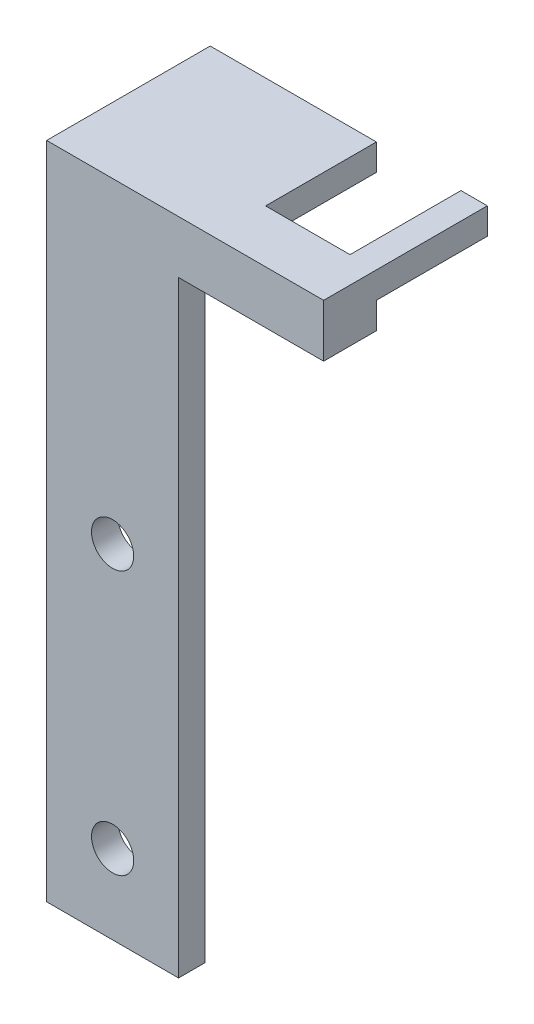
ISO-10303-21;
HEADER;
FILE_DESCRIPTION(('STEP AP214'),'2;1');
FILE_NAME('part.step','',(''),(''),'','','');
FILE_SCHEMA(('AUTOMOTIVE_DESIGN { 1 0 10303 214 1 1 1 1 }'));
ENDSEC;
DATA;
#1=APPLICATION_CONTEXT('core data for automotive mechanical design processes');
#2=APPLICATION_PROTOCOL_DEFINITION('international standard','automotive_design',2000,#1);
#3=PRODUCT_CONTEXT('',#1,'mechanical');
#4=PRODUCT('Part','Part','',(#3));
#5=PRODUCT_RELATED_PRODUCT_CATEGORY('part','',(#4));
#6=PRODUCT_DEFINITION_FORMATION('','',#4);
#7=PRODUCT_DEFINITION_CONTEXT('part definition',#1,'design');
#8=PRODUCT_DEFINITION('design','',#6,#7);
#9=PRODUCT_DEFINITION_SHAPE('','',#8);
#10=(LENGTH_UNIT() NAMED_UNIT(*) SI_UNIT(.MILLI.,.METRE.));
#11=(NAMED_UNIT(*) PLANE_ANGLE_UNIT() SI_UNIT($,.RADIAN.));
#12=(NAMED_UNIT(*) SI_UNIT($,.STERADIAN.) SOLID_ANGLE_UNIT());
#13=UNCERTAINTY_MEASURE_WITH_UNIT(LENGTH_MEASURE(1.E-05),#10,'distance_accuracy_value','');
#14=(GEOMETRIC_REPRESENTATION_CONTEXT(3) GLOBAL_UNCERTAINTY_ASSIGNED_CONTEXT((#13)) GLOBAL_UNIT_ASSIGNED_CONTEXT((#10,
#11,#12)) REPRESENTATION_CONTEXT('',''));
#15=CARTESIAN_POINT('',(0.,0.,0.));
#16=DIRECTION('',(0.,0.,1.));
#17=DIRECTION('',(1.,0.,0.));
#18=AXIS2_PLACEMENT_3D('',#15,#16,#17);
#19=CARTESIAN_POINT('',(0.,26.2979779965765,0.));
#20=DIRECTION('',(0.,1.,0.));
#21=DIRECTION('',(0.,0.,1.));
#22=AXIS2_PLACEMENT_3D('',#19,#20,#21);
#23=PLANE('',#22);
#24=DIRECTION('',(1.,0.,0.));
#25=VECTOR('',#24,1.);
#26=CARTESIAN_POINT('',(0.,26.2979779965765,-3.175));
#27=LINE('',#26,#25);
#28=CARTESIAN_POINT('',(-16.342182644396,26.2979779965765,-3.175));
#29=VERTEX_POINT('',#28);
#30=CARTESIAN_POINT('',(3.66031735560397,26.2979779965765,-3.175));
#31=VERTEX_POINT('',#30);
#32=EDGE_CURVE('E198',#29,#31,#27,.T.);
#33=ORIENTED_EDGE('',*,*,#32,.F.);
#34=DIRECTION('',(0.,0.,-1.));
#35=VECTOR('',#34,1.);
#36=CARTESIAN_POINT('',(-16.342182644396,26.2979779965765,0.));
#37=LINE('',#36,#35);
#38=CARTESIAN_POINT('',(-16.342182644396,26.2979779965765,-16.51));
#39=VERTEX_POINT('',#38);
#40=EDGE_CURVE('E75',#29,#39,#37,.T.);
#41=ORIENTED_EDGE('',*,*,#40,.T.);
#42=DIRECTION('',(1.,0.,0.));
#43=VECTOR('',#42,1.);
#44=CARTESIAN_POINT('',(0.,26.2979779965765,-16.51));
#45=LINE('',#44,#43);
#46=CARTESIAN_POINT('',(3.66031735560397,26.2979779965765,-16.51));
#47=VERTEX_POINT('',#46);
#48=EDGE_CURVE('E179',#39,#47,#45,.T.);
#49=ORIENTED_EDGE('',*,*,#48,.T.);
#50=DIRECTION('',(0.,0.,-1.));
#51=VECTOR('',#50,1.);
#52=CARTESIAN_POINT('',(3.66031735560397,26.2979779965765,0.));
#53=LINE('',#52,#51);
#54=EDGE_CURVE('E181',#31,#47,#53,.T.);
#55=ORIENTED_EDGE('',*,*,#54,.F.);
#56=EDGE_LOOP('',(#33,#41,#49,#55));
#57=FACE_BOUND('',#56,.T.);
#58=ADVANCED_FACE('F35',(#57),#23,.F.);
#59=DIRECTION('',(1.,0.,0.));
#60=VECTOR('',#59,1.);
#61=CARTESIAN_POINT('',(0.,26.2979779965765,-3.175));
#62=LINE('',#61,#60);
#63=CARTESIAN_POINT('',(13.820317355604,26.2979779965765,-3.175));
#64=VERTEX_POINT('',#63);
#65=CARTESIAN_POINT('',(16.995317355604,26.2979779965765,-3.175));
#66=VERTEX_POINT('',#65);
#67=EDGE_CURVE('E11',#64,#66,#62,.T.);
#68=ORIENTED_EDGE('',*,*,#67,.F.);
#69=DIRECTION('',(0.,0.,-1.));
#70=VECTOR('',#69,1.);
#71=CARTESIAN_POINT('',(13.820317355604,26.2979779965765,0.));
#72=LINE('',#71,#70);
#73=CARTESIAN_POINT('',(13.820317355604,26.2979779965765,-16.5312104718893));
#74=VERTEX_POINT('',#73);
#75=EDGE_CURVE('E184',#64,#74,#72,.T.);
#76=ORIENTED_EDGE('',*,*,#75,.T.);
#77=DIRECTION('',(-1.,0.,0.));
#78=VECTOR('',#77,1.);
#79=CARTESIAN_POINT('',(0.,26.2979779965765,-16.5312104718893));
#80=LINE('',#79,#78);
#81=CARTESIAN_POINT('',(16.995317355604,26.2979779965765,-16.5312104718893));
#82=VERTEX_POINT('',#81);
#83=EDGE_CURVE('E187',#82,#74,#80,.T.);
#84=ORIENTED_EDGE('',*,*,#83,.F.);
#85=DIRECTION('',(0.,0.,-1.));
#86=VECTOR('',#85,1.);
#87=CARTESIAN_POINT('',(16.995317355604,26.2979779965765,0.));
#88=LINE('',#87,#86);
#89=EDGE_CURVE('E162',#66,#82,#88,.T.);
#90=ORIENTED_EDGE('',*,*,#89,.F.);
#91=EDGE_LOOP('',(#68,#76,#84,#90));
#92=FACE_BOUND('',#91,.T.);
#93=ADVANCED_FACE('F259',(#92),#23,.F.);
#94=CARTESIAN_POINT('',(0.,0.,0.));
#95=DIRECTION('',(0.,0.,1.));
#96=DIRECTION('',(1.,0.,0.));
#97=AXIS2_PLACEMENT_3D('',#94,#95,#96);
#98=PLANE('',#97);
#99=CARTESIAN_POINT('',(-8.40468264439601,-40.3770220034235,0.));
#100=DIRECTION('',(0.,0.,1.));
#101=DIRECTION('',(1.,0.,0.));
#102=AXIS2_PLACEMENT_3D('',#99,#100,#101);
#103=CIRCLE('',#102,2.54);
#104=CARTESIAN_POINT('',(-5.86468264439601,-40.3770220034235,0.));
#105=VERTEX_POINT('',#104);
#106=EDGE_CURVE('E138',#105,#105,#103,.T.);
#107=ORIENTED_EDGE('',*,*,#106,.T.);
#108=EDGE_LOOP('',(#107));
#109=FACE_BOUND('',#108,.T.);
#110=CARTESIAN_POINT('',(-8.40468264439602,-8.62702200342354,0.));
#111=DIRECTION('',(0.,0.,1.));
#112=DIRECTION('',(1.,0.,0.));
#113=AXIS2_PLACEMENT_3D('',#110,#111,#112);
#114=CIRCLE('',#113,2.54);
#115=CARTESIAN_POINT('',(-5.86468264439602,-8.62702200342354,0.));
#116=VERTEX_POINT('',#115);
#117=EDGE_CURVE('E132',#116,#116,#114,.T.);
#118=ORIENTED_EDGE('',*,*,#117,.T.);
#119=EDGE_LOOP('',(#118));
#120=FACE_BOUND('',#119,.T.);
#121=DIRECTION('',(0.,-1.,0.));
#122=VECTOR('',#121,1.);
#123=CARTESIAN_POINT('',(-16.342182644396,29.4729779965765,0.));
#124=LINE('',#123,#122);
#125=CARTESIAN_POINT('',(-16.342182644396,23.1229779965765,0.));
#126=VERTEX_POINT('',#125);
#127=CARTESIAN_POINT('',(-16.342182644396,-49.9020220034235,0.));
#128=VERTEX_POINT('',#127);
#129=EDGE_CURVE('E65',#126,#128,#124,.T.);
#130=ORIENTED_EDGE('',*,*,#129,.F.);
#131=DIRECTION('',(1.,0.,0.));
#132=VECTOR('',#131,1.);
#133=CARTESIAN_POINT('',(0.,23.1229779965765,0.));
#134=LINE('',#133,#132);
#135=CARTESIAN_POINT('',(-0.46718264439603,23.1229779965765,0.));
#136=VERTEX_POINT('',#135);
#137=EDGE_CURVE('E197',#126,#136,#134,.T.);
#138=ORIENTED_EDGE('',*,*,#137,.T.);
#139=DIRECTION('',(0.,1.,0.));
#140=VECTOR('',#139,1.);
#141=CARTESIAN_POINT('',(-0.46718264439603,29.4729779965765,0.));
#142=LINE('',#141,#140);
#143=CARTESIAN_POINT('',(-0.467182644396016,-49.9020220034235,0.));
#144=VERTEX_POINT('',#143);
#145=EDGE_CURVE('E118',#144,#136,#142,.T.);
#146=ORIENTED_EDGE('',*,*,#145,.F.);
#147=DIRECTION('',(1.,0.,0.));
#148=VECTOR('',#147,1.);
#149=CARTESIAN_POINT('',(-16.342182644396,-49.9020220034235,0.));
#150=LINE('',#149,#148);
#151=EDGE_CURVE('E126',#128,#144,#150,.T.);
#152=ORIENTED_EDGE('',*,*,#151,.F.);
#153=EDGE_LOOP('',(#130,#138,#146,#152));
#154=FACE_BOUND('',#153,.T.);
#155=ADVANCED_FACE('F281',(#109,#120,#154),#98,.F.);
#156=CARTESIAN_POINT('',(-0.46718264439603,29.4729779965765,3.175));
#157=DIRECTION('',(-1.,0.,0.));
#158=DIRECTION('',(0.,-1.,0.));
#159=AXIS2_PLACEMENT_3D('',#156,#157,#158);
#160=PLANE('',#159);
#161=ORIENTED_EDGE('',*,*,#145,.T.);
#162=DIRECTION('',(0.,0.,-1.));
#163=VECTOR('',#162,1.);
#164=CARTESIAN_POINT('',(-0.46718264439603,23.1229779965765,0.));
#165=LINE('',#164,#163);
#166=CARTESIAN_POINT('',(-0.46718264439603,23.1229779965765,3.175));
#167=VERTEX_POINT('',#166);
#168=EDGE_CURVE('E204',#167,#136,#165,.T.);
#169=ORIENTED_EDGE('',*,*,#168,.F.);
#170=DIRECTION('',(0.,1.,0.));
#171=VECTOR('',#170,1.);
#172=CARTESIAN_POINT('',(-0.46718264439603,29.4729779965765,3.175));
#173=LINE('',#172,#171);
#174=CARTESIAN_POINT('',(-0.467182644396016,-49.9020220034235,3.175));
#175=VERTEX_POINT('',#174);
#176=EDGE_CURVE('E112',#175,#167,#173,.T.);
#177=ORIENTED_EDGE('',*,*,#176,.F.);
#178=DIRECTION('',(0.,0.,-1.));
#179=VECTOR('',#178,1.);
#180=CARTESIAN_POINT('',(-0.467182644396016,-49.9020220034235,3.175));
#181=LINE('',#180,#179);
#182=EDGE_CURVE('E109',#175,#144,#181,.T.);
#183=ORIENTED_EDGE('',*,*,#182,.T.);
#184=EDGE_LOOP('',(#161,#169,#177,#183));
#185=FACE_BOUND('',#184,.T.);
#186=ADVANCED_FACE('F282',(#185),#160,.F.);
#187=CARTESIAN_POINT('',(0.,0.,3.175));
#188=DIRECTION('',(0.,0.,1.));
#189=DIRECTION('',(1.,0.,0.));
#190=AXIS2_PLACEMENT_3D('',#187,#188,#189);
#191=PLANE('',#190);
#192=CARTESIAN_POINT('',(-8.40468264439602,-8.62702200342354,3.175));
#193=DIRECTION('',(0.,0.,1.));
#194=DIRECTION('',(1.,0.,0.));
#195=AXIS2_PLACEMENT_3D('',#192,#193,#194);
#196=CIRCLE('',#195,2.54);
#197=CARTESIAN_POINT('',(-5.86468264439602,-8.62702200342354,3.175));
#198=VERTEX_POINT('',#197);
#199=EDGE_CURVE('E129',#198,#198,#196,.T.);
#200=ORIENTED_EDGE('',*,*,#199,.F.);
#201=EDGE_LOOP('',(#200));
#202=FACE_BOUND('',#201,.T.);
#203=DIRECTION('',(0.,-1.,0.));
#204=VECTOR('',#203,1.);
#205=CARTESIAN_POINT('',(-16.342182644396,29.4729779965765,3.175));
#206=LINE('',#205,#204);
#207=CARTESIAN_POINT('',(-16.342182644396,29.4729779965765,3.175));
#208=VERTEX_POINT('',#207);
#209=CARTESIAN_POINT('',(-16.342182644396,-49.9020220034235,3.175));
#210=VERTEX_POINT('',#209);
#211=EDGE_CURVE('E113',#208,#210,#206,.T.);
#212=ORIENTED_EDGE('',*,*,#211,.T.);
#213=DIRECTION('',(1.,0.,0.));
#214=VECTOR('',#213,1.);
#215=CARTESIAN_POINT('',(-16.342182644396,-49.9020220034235,3.175));
#216=LINE('',#215,#214);
#217=EDGE_CURVE('E106',#210,#175,#216,.T.);
#218=ORIENTED_EDGE('',*,*,#217,.T.);
#219=ORIENTED_EDGE('',*,*,#176,.T.);
#220=DIRECTION('',(-1.,0.,0.));
#221=VECTOR('',#220,1.);
#222=CARTESIAN_POINT('',(0.,23.1229779965765,3.175));
#223=LINE('',#222,#221);
#224=CARTESIAN_POINT('',(16.995317355604,23.1229779965765,3.175));
#225=VERTEX_POINT('',#224);
#226=EDGE_CURVE('E207',#225,#167,#223,.T.);
#227=ORIENTED_EDGE('',*,*,#226,.F.);
#228=DIRECTION('',(0.,1.,0.));
#229=VECTOR('',#228,1.);
#230=CARTESIAN_POINT('',(16.995317355604,26.2979779965765,3.175));
#231=LINE('',#230,#229);
#232=CARTESIAN_POINT('',(16.995317355604,29.4729779965765,3.175));
#233=VERTEX_POINT('',#232);
#234=EDGE_CURVE('E144',#225,#233,#231,.T.);
#235=ORIENTED_EDGE('',*,*,#234,.T.);
#236=DIRECTION('',(-1.,0.,0.));
#237=VECTOR('',#236,1.);
#238=CARTESIAN_POINT('',(-16.342182644396,29.4729779965765,3.175));
#239=LINE('',#238,#237);
#240=EDGE_CURVE('E52',#233,#208,#239,.T.);
#241=ORIENTED_EDGE('',*,*,#240,.T.);
#242=EDGE_LOOP('',(#212,#218,#219,#227,#235,#241));
#243=FACE_BOUND('',#242,.T.);
#244=CARTESIAN_POINT('',(-8.40468264439601,-40.3770220034235,3.175));
#245=DIRECTION('',(0.,0.,1.));
#246=DIRECTION('',(1.,0.,0.));
#247=AXIS2_PLACEMENT_3D('',#244,#245,#246);
#248=CIRCLE('',#247,2.54);
#249=CARTESIAN_POINT('',(-5.86468264439601,-40.3770220034235,3.175));
#250=VERTEX_POINT('',#249);
#251=EDGE_CURVE('E135',#250,#250,#248,.T.);
#252=ORIENTED_EDGE('',*,*,#251,.F.);
#253=EDGE_LOOP('',(#252));
#254=FACE_BOUND('',#253,.T.);
#255=ADVANCED_FACE('F116',(#202,#243,#254),#191,.T.);
#256=CARTESIAN_POINT('',(-16.342182644396,29.4729779965765,3.175));
#257=DIRECTION('',(1.,0.,0.));
#258=DIRECTION('',(0.,1.,0.));
#259=AXIS2_PLACEMENT_3D('',#256,#257,#258);
#260=PLANE('',#259);
#261=DIRECTION('',(0.,0.,-1.));
#262=VECTOR('',#261,1.);
#263=CARTESIAN_POINT('',(-16.342182644396,23.1229779965765,0.));
#264=LINE('',#263,#262);
#265=CARTESIAN_POINT('',(-16.342182644396,23.1229779965765,-3.175));
#266=VERTEX_POINT('',#265);
#267=EDGE_CURVE('E201',#126,#266,#264,.T.);
#268=ORIENTED_EDGE('',*,*,#267,.F.);
#269=ORIENTED_EDGE('',*,*,#129,.T.);
#270=DIRECTION('',(0.,0.,-1.));
#271=VECTOR('',#270,1.);
#272=CARTESIAN_POINT('',(-16.342182644396,-49.9020220034235,3.175));
#273=LINE('',#272,#271);
#274=EDGE_CURVE('E44',#210,#128,#273,.T.);
#275=ORIENTED_EDGE('',*,*,#274,.F.);
#276=ORIENTED_EDGE('',*,*,#211,.F.);
#277=DIRECTION('',(0.,0.,-1.));
#278=VECTOR('',#277,1.);
#279=CARTESIAN_POINT('',(-16.342182644396,29.4729779965765,3.175));
#280=LINE('',#279,#278);
#281=CARTESIAN_POINT('',(-16.342182644396,29.4729779965765,-16.51));
#282=VERTEX_POINT('',#281);
#283=EDGE_CURVE('E120',#208,#282,#280,.T.);
#284=ORIENTED_EDGE('',*,*,#283,.T.);
#285=DIRECTION('',(0.,1.,0.));
#286=VECTOR('',#285,1.);
#287=CARTESIAN_POINT('',(-16.342182644396,26.2979779965765,-16.51));
#288=LINE('',#287,#286);
#289=EDGE_CURVE('E141',#39,#282,#288,.T.);
#290=ORIENTED_EDGE('',*,*,#289,.F.);
#291=ORIENTED_EDGE('',*,*,#40,.F.);
#292=DIRECTION('',(0.,1.,0.));
#293=VECTOR('',#292,1.);
#294=CARTESIAN_POINT('',(-16.342182644396,23.1229779965765,-3.175));
#295=LINE('',#294,#293);
#296=EDGE_CURVE('E177',#266,#29,#295,.T.);
#297=ORIENTED_EDGE('',*,*,#296,.F.);
#298=EDGE_LOOP('',(#268,#269,#275,#276,#284,#290,#291,#297));
#299=FACE_BOUND('',#298,.T.);
#300=ADVANCED_FACE('F37',(#299),#260,.F.);
#301=CARTESIAN_POINT('',(-16.342182644396,-49.9020220034235,3.175));
#302=DIRECTION('',(0.,1.,0.));
#303=DIRECTION('',(0.,0.,1.));
#304=AXIS2_PLACEMENT_3D('',#301,#302,#303);
#305=PLANE('',#304);
#306=ORIENTED_EDGE('',*,*,#151,.T.);
#307=ORIENTED_EDGE('',*,*,#182,.F.);
#308=ORIENTED_EDGE('',*,*,#217,.F.);
#309=ORIENTED_EDGE('',*,*,#274,.T.);
#310=EDGE_LOOP('',(#306,#307,#308,#309));
#311=FACE_BOUND('',#310,.T.);
#312=ADVANCED_FACE('F107',(#311),#305,.F.);
#313=CARTESIAN_POINT('',(-16.342182644396,29.4729779965765,3.175));
#314=DIRECTION('',(0.,-1.,0.));
#315=DIRECTION('',(0.,0.,-1.));
#316=AXIS2_PLACEMENT_3D('',#313,#314,#315);
#317=PLANE('',#316);
#318=ORIENTED_EDGE('',*,*,#240,.F.);
#319=DIRECTION('',(0.,0.,-1.));
#320=VECTOR('',#319,1.);
#321=CARTESIAN_POINT('',(16.995317355604,29.4729779965765,0.));
#322=LINE('',#321,#320);
#323=CARTESIAN_POINT('',(16.995317355604,29.4729779965765,-16.5312104718893));
#324=VERTEX_POINT('',#323);
#325=EDGE_CURVE('E174',#233,#324,#322,.T.);
#326=ORIENTED_EDGE('',*,*,#325,.T.);
#327=DIRECTION('',(-1.,0.,0.));
#328=VECTOR('',#327,1.);
#329=CARTESIAN_POINT('',(0.,29.4729779965765,-16.5312104718893));
#330=LINE('',#329,#328);
#331=CARTESIAN_POINT('',(13.820317355604,29.4729779965765,-16.5312104718893));
#332=VERTEX_POINT('',#331);
#333=EDGE_CURVE('E171',#324,#332,#330,.T.);
#334=ORIENTED_EDGE('',*,*,#333,.T.);
#335=DIRECTION('',(0.,0.,-1.));
#336=VECTOR('',#335,1.);
#337=CARTESIAN_POINT('',(13.820317355604,29.4729779965765,0.));
#338=LINE('',#337,#336);
#339=CARTESIAN_POINT('',(13.820317355604,29.4729779965765,-3.175));
#340=VERTEX_POINT('',#339);
#341=EDGE_CURVE('E168',#340,#332,#338,.T.);
#342=ORIENTED_EDGE('',*,*,#341,.F.);
#343=DIRECTION('',(1.,0.,0.));
#344=VECTOR('',#343,1.);
#345=CARTESIAN_POINT('',(0.,29.4729779965765,-3.175));
#346=LINE('',#345,#344);
#347=CARTESIAN_POINT('',(3.66031735560397,29.4729779965765,-3.175));
#348=VERTEX_POINT('',#347);
#349=EDGE_CURVE('E166',#348,#340,#346,.T.);
#350=ORIENTED_EDGE('',*,*,#349,.F.);
#351=DIRECTION('',(0.,0.,-1.));
#352=VECTOR('',#351,1.);
#353=CARTESIAN_POINT('',(3.66031735560397,29.4729779965765,0.));
#354=LINE('',#353,#352);
#355=CARTESIAN_POINT('',(3.66031735560397,29.4729779965765,-16.51));
#356=VERTEX_POINT('',#355);
#357=EDGE_CURVE('E163',#348,#356,#354,.T.);
#358=ORIENTED_EDGE('',*,*,#357,.T.);
#359=DIRECTION('',(1.,0.,0.));
#360=VECTOR('',#359,1.);
#361=CARTESIAN_POINT('',(0.,29.4729779965765,-16.51));
#362=LINE('',#361,#360);
#363=EDGE_CURVE('E159',#282,#356,#362,.T.);
#364=ORIENTED_EDGE('',*,*,#363,.F.);
#365=ORIENTED_EDGE('',*,*,#283,.F.);
#366=EDGE_LOOP('',(#318,#326,#334,#342,#350,#358,#364,#365));
#367=FACE_BOUND('',#366,.T.);
#368=ADVANCED_FACE('F245',(#367),#317,.F.);
#369=CARTESIAN_POINT('',(-8.40468264439602,-8.62702200342354,3.175));
#370=DIRECTION('',(0.,0.,-1.));
#371=DIRECTION('',(-1.,0.,0.));
#372=AXIS2_PLACEMENT_3D('',#369,#370,#371);
#373=CYLINDRICAL_SURFACE('',#372,2.54);
#374=ORIENTED_EDGE('',*,*,#199,.T.);
#375=EDGE_LOOP('',(#374));
#376=FACE_BOUND('',#375,.T.);
#377=ORIENTED_EDGE('',*,*,#117,.F.);
#378=EDGE_LOOP('',(#377));
#379=FACE_BOUND('',#378,.T.);
#380=ADVANCED_FACE('F318',(#376,#379),#373,.F.);
#381=CARTESIAN_POINT('',(-8.40468264439601,-40.3770220034235,3.175));
#382=DIRECTION('',(0.,0.,-1.));
#383=DIRECTION('',(-1.,0.,0.));
#384=AXIS2_PLACEMENT_3D('',#381,#382,#383);
#385=CYLINDRICAL_SURFACE('',#384,2.54);
#386=ORIENTED_EDGE('',*,*,#251,.T.);
#387=EDGE_LOOP('',(#386));
#388=FACE_BOUND('',#387,.T.);
#389=ORIENTED_EDGE('',*,*,#106,.F.);
#390=EDGE_LOOP('',(#389));
#391=FACE_BOUND('',#390,.T.);
#392=ADVANCED_FACE('F304',(#388,#391),#385,.F.);
#393=CARTESIAN_POINT('',(0.,26.2979779965765,-16.51));
#394=DIRECTION('',(0.,0.,1.));
#395=DIRECTION('',(1.,0.,0.));
#396=AXIS2_PLACEMENT_3D('',#393,#394,#395);
#397=PLANE('',#396);
#398=ORIENTED_EDGE('',*,*,#363,.T.);
#399=DIRECTION('',(0.,1.,0.));
#400=VECTOR('',#399,1.);
#401=CARTESIAN_POINT('',(3.66031735560397,26.2979779965765,-16.51));
#402=LINE('',#401,#400);
#403=EDGE_CURVE('E155',#47,#356,#402,.T.);
#404=ORIENTED_EDGE('',*,*,#403,.F.);
#405=ORIENTED_EDGE('',*,*,#48,.F.);
#406=ORIENTED_EDGE('',*,*,#289,.T.);
#407=EDGE_LOOP('',(#398,#404,#405,#406));
#408=FACE_BOUND('',#407,.T.);
#409=ADVANCED_FACE('F301',(#408),#397,.F.);
#410=CARTESIAN_POINT('',(3.66031735560397,26.2979779965765,0.));
#411=DIRECTION('',(1.,0.,0.));
#412=DIRECTION('',(0.,0.,-1.));
#413=AXIS2_PLACEMENT_3D('',#410,#411,#412);
#414=PLANE('',#413);
#415=ORIENTED_EDGE('',*,*,#357,.F.);
#416=DIRECTION('',(0.,1.,0.));
#417=VECTOR('',#416,1.);
#418=CARTESIAN_POINT('',(3.66031735560397,26.2979779965765,-3.175));
#419=LINE('',#418,#417);
#420=EDGE_CURVE('E153',#31,#348,#419,.T.);
#421=ORIENTED_EDGE('',*,*,#420,.F.);
#422=ORIENTED_EDGE('',*,*,#54,.T.);
#423=ORIENTED_EDGE('',*,*,#403,.T.);
#424=EDGE_LOOP('',(#415,#421,#422,#423));
#425=FACE_BOUND('',#424,.T.);
#426=ADVANCED_FACE('F240',(#425),#414,.T.);
#427=CARTESIAN_POINT('',(0.,26.2979779965765,-3.175));
#428=DIRECTION('',(0.,0.,1.));
#429=DIRECTION('',(1.,0.,0.));
#430=AXIS2_PLACEMENT_3D('',#427,#428,#429);
#431=PLANE('',#430);
#432=ORIENTED_EDGE('',*,*,#349,.T.);
#433=DIRECTION('',(0.,1.,0.));
#434=VECTOR('',#433,1.);
#435=CARTESIAN_POINT('',(13.820317355604,26.2979779965765,-3.175));
#436=LINE('',#435,#434);
#437=EDGE_CURVE('E150',#64,#340,#436,.T.);
#438=ORIENTED_EDGE('',*,*,#437,.F.);
#439=ORIENTED_EDGE('',*,*,#67,.T.);
#440=DIRECTION('',(0.,1.,0.));
#441=VECTOR('',#440,1.);
#442=CARTESIAN_POINT('',(16.995317355604,23.1229779965765,-3.175));
#443=LINE('',#442,#441);
#444=CARTESIAN_POINT('',(16.995317355604,23.1229779965765,-3.175));
#445=VERTEX_POINT('',#444);
#446=EDGE_CURVE('E194',#445,#66,#443,.T.);
#447=ORIENTED_EDGE('',*,*,#446,.F.);
#448=DIRECTION('',(1.,0.,0.));
#449=VECTOR('',#448,1.);
#450=CARTESIAN_POINT('',(0.,23.1229779965765,-3.175));
#451=LINE('',#450,#449);
#452=EDGE_CURVE('E213',#266,#445,#451,.T.);
#453=ORIENTED_EDGE('',*,*,#452,.F.);
#454=ORIENTED_EDGE('',*,*,#296,.T.);
#455=ORIENTED_EDGE('',*,*,#32,.T.);
#456=ORIENTED_EDGE('',*,*,#420,.T.);
#457=EDGE_LOOP('',(#432,#438,#439,#447,#453,#454,#455,#456));
#458=FACE_BOUND('',#457,.T.);
#459=ADVANCED_FACE('F230',(#458),#431,.F.);
#460=CARTESIAN_POINT('',(13.820317355604,26.2979779965765,0.));
#461=DIRECTION('',(1.,0.,0.));
#462=DIRECTION('',(0.,0.,-1.));
#463=AXIS2_PLACEMENT_3D('',#460,#461,#462);
#464=PLANE('',#463);
#465=ORIENTED_EDGE('',*,*,#341,.T.);
#466=DIRECTION('',(0.,1.,0.));
#467=VECTOR('',#466,1.);
#468=CARTESIAN_POINT('',(13.820317355604,26.2979779965765,-16.5312104718893));
#469=LINE('',#468,#467);
#470=EDGE_CURVE('E148',#74,#332,#469,.T.);
#471=ORIENTED_EDGE('',*,*,#470,.F.);
#472=ORIENTED_EDGE('',*,*,#75,.F.);
#473=ORIENTED_EDGE('',*,*,#437,.T.);
#474=EDGE_LOOP('',(#465,#471,#472,#473));
#475=FACE_BOUND('',#474,.T.);
#476=ADVANCED_FACE('F250',(#475),#464,.F.);
#477=CARTESIAN_POINT('',(0.,26.2979779965765,-16.5312104718893));
#478=DIRECTION('',(0.,0.,-1.));
#479=DIRECTION('',(-1.,0.,0.));
#480=AXIS2_PLACEMENT_3D('',#477,#478,#479);
#481=PLANE('',#480);
#482=ORIENTED_EDGE('',*,*,#333,.F.);
#483=DIRECTION('',(0.,1.,0.));
#484=VECTOR('',#483,1.);
#485=CARTESIAN_POINT('',(16.995317355604,26.2979779965765,-16.5312104718893));
#486=LINE('',#485,#484);
#487=EDGE_CURVE('E146',#82,#324,#486,.T.);
#488=ORIENTED_EDGE('',*,*,#487,.F.);
#489=ORIENTED_EDGE('',*,*,#83,.T.);
#490=ORIENTED_EDGE('',*,*,#470,.T.);
#491=EDGE_LOOP('',(#482,#488,#489,#490));
#492=FACE_BOUND('',#491,.T.);
#493=ADVANCED_FACE('F262',(#492),#481,.T.);
#494=CARTESIAN_POINT('',(16.995317355604,26.2979779965765,0.));
#495=DIRECTION('',(1.,0.,0.));
#496=DIRECTION('',(0.,0.,-1.));
#497=AXIS2_PLACEMENT_3D('',#494,#495,#496);
#498=PLANE('',#497);
#499=ORIENTED_EDGE('',*,*,#325,.F.);
#500=ORIENTED_EDGE('',*,*,#234,.F.);
#501=DIRECTION('',(0.,0.,1.));
#502=VECTOR('',#501,1.);
#503=CARTESIAN_POINT('',(16.995317355604,23.1229779965765,0.));
#504=LINE('',#503,#502);
#505=EDGE_CURVE('E210',#445,#225,#504,.T.);
#506=ORIENTED_EDGE('',*,*,#505,.F.);
#507=ORIENTED_EDGE('',*,*,#446,.T.);
#508=ORIENTED_EDGE('',*,*,#89,.T.);
#509=ORIENTED_EDGE('',*,*,#487,.T.);
#510=EDGE_LOOP('',(#499,#500,#506,#507,#508,#509));
#511=FACE_BOUND('',#510,.T.);
#512=ADVANCED_FACE('F265',(#511),#498,.T.);
#513=CARTESIAN_POINT('',(0.,23.1229779965765,0.));
#514=DIRECTION('',(0.,-1.,0.));
#515=DIRECTION('',(0.,0.,-1.));
#516=AXIS2_PLACEMENT_3D('',#513,#514,#515);
#517=PLANE('',#516);
#518=ORIENTED_EDGE('',*,*,#267,.T.);
#519=ORIENTED_EDGE('',*,*,#452,.T.);
#520=ORIENTED_EDGE('',*,*,#505,.T.);
#521=ORIENTED_EDGE('',*,*,#226,.T.);
#522=ORIENTED_EDGE('',*,*,#168,.T.);
#523=ORIENTED_EDGE('',*,*,#137,.F.);
#524=EDGE_LOOP('',(#518,#519,#520,#521,#522,#523));
#525=FACE_BOUND('',#524,.T.);
#526=ADVANCED_FACE('F221',(#525),#517,.T.);
#527=CLOSED_SHELL('',(#58,#93,#155,#186,#255,#300,#312,#368,#380,#392,#409,#426,#459,#476,#493,
#512,#526));
#528=MANIFOLD_SOLID_BREP('B2',#527);
#529=ADVANCED_BREP_SHAPE_REPRESENTATION('',(#18,#528),#14);
#530=SHAPE_DEFINITION_REPRESENTATION(#9,#529);
ENDSEC;
END-ISO-10303-21;
